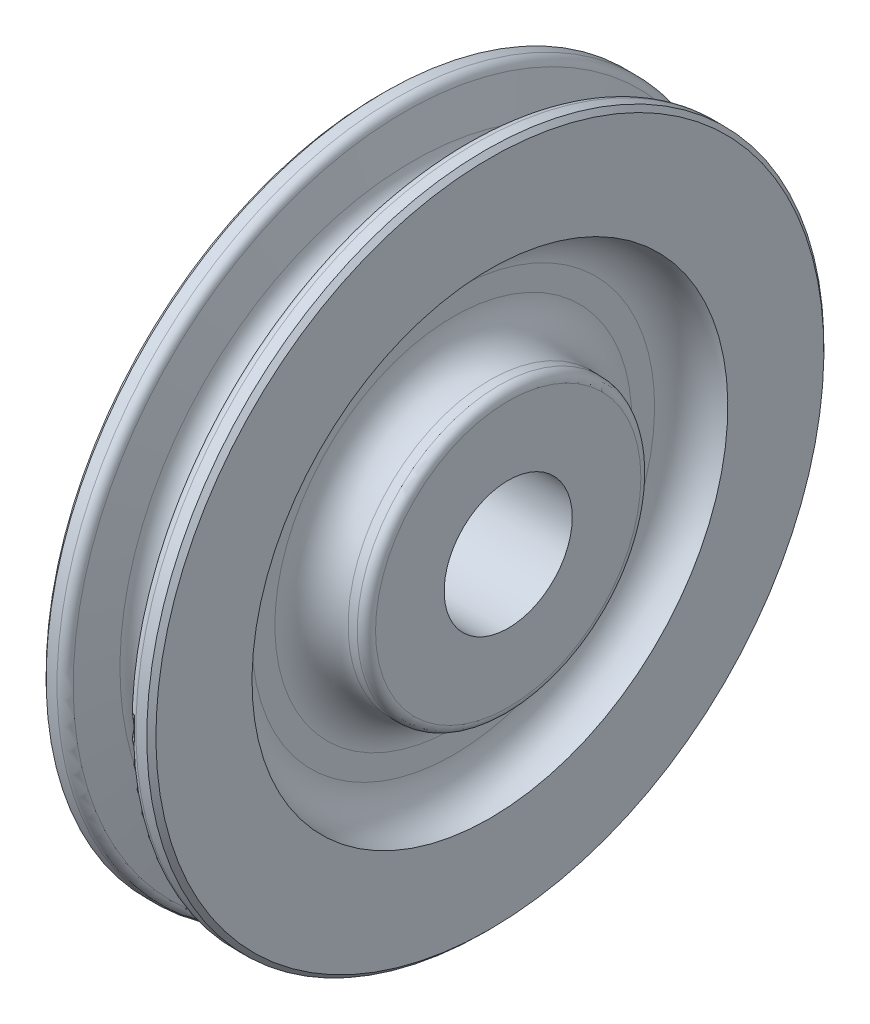
ISO-10303-21;
HEADER;
FILE_DESCRIPTION(('STEP AP214'),'2;1');
FILE_NAME('part.step','',(''),(''),'','','');
FILE_SCHEMA(('AUTOMOTIVE_DESIGN { 1 0 10303 214 1 1 1 1 }'));
ENDSEC;
DATA;
#1=APPLICATION_CONTEXT('core data for automotive mechanical design processes');
#2=APPLICATION_PROTOCOL_DEFINITION('international standard','automotive_design',2000,#1);
#3=PRODUCT_CONTEXT('',#1,'mechanical');
#4=PRODUCT('Part','Part','',(#3));
#5=PRODUCT_RELATED_PRODUCT_CATEGORY('part','',(#4));
#6=PRODUCT_DEFINITION_FORMATION('','',#4);
#7=PRODUCT_DEFINITION_CONTEXT('part definition',#1,'design');
#8=PRODUCT_DEFINITION('design','',#6,#7);
#9=PRODUCT_DEFINITION_SHAPE('','',#8);
#10=(LENGTH_UNIT() NAMED_UNIT(*) SI_UNIT(.MILLI.,.METRE.));
#11=(NAMED_UNIT(*) PLANE_ANGLE_UNIT() SI_UNIT($,.RADIAN.));
#12=(NAMED_UNIT(*) SI_UNIT($,.STERADIAN.) SOLID_ANGLE_UNIT());
#13=UNCERTAINTY_MEASURE_WITH_UNIT(LENGTH_MEASURE(1.E-05),#10,'distance_accuracy_value','');
#14=(GEOMETRIC_REPRESENTATION_CONTEXT(3) GLOBAL_UNCERTAINTY_ASSIGNED_CONTEXT((#13)) GLOBAL_UNIT_ASSIGNED_CONTEXT((#10,
#11,#12)) REPRESENTATION_CONTEXT('',''));
#15=CARTESIAN_POINT('',(0.,0.,0.));
#16=DIRECTION('',(0.,0.,1.));
#17=DIRECTION('',(1.,0.,0.));
#18=AXIS2_PLACEMENT_3D('',#15,#16,#17);
#19=CARTESIAN_POINT('',(0.,0.,0.));
#20=DIRECTION('',(-1.,0.,0.));
#21=DIRECTION('',(0.,-1.,0.));
#22=AXIS2_PLACEMENT_3D('',#19,#20,#21);
#23=TOROIDAL_SURFACE('',#22,51.5937500000002,3.96875);
#24=CARTESIAN_POINT('',(-3.88395786670477,0.,0.));
#25=DIRECTION('',(-1.,0.,0.));
#26=DIRECTION('',(0.,-1.,0.));
#27=AXIS2_PLACEMENT_3D('',#24,#25,#26);
#28=CIRCLE('',#27,50.7777549925632);
#29=CARTESIAN_POINT('',(-3.88395786670477,-50.7777549925632,0.));
#30=VERTEX_POINT('',#29);
#31=EDGE_CURVE('E10',#30,#30,#28,.T.);
#32=ORIENTED_EDGE('',*,*,#31,.F.);
#33=EDGE_LOOP('',(#32));
#34=FACE_BOUND('',#33,.T.);
#35=CARTESIAN_POINT('',(3.88395786670477,0.,0.));
#36=DIRECTION('',(-1.,0.,0.));
#37=DIRECTION('',(0.,-1.,0.));
#38=AXIS2_PLACEMENT_3D('',#35,#36,#37);
#39=CIRCLE('',#38,50.7777549925632);
#40=CARTESIAN_POINT('',(3.88395786670477,-50.7777549925632,0.));
#41=VERTEX_POINT('',#40);
#42=EDGE_CURVE('E422',#41,#41,#39,.T.);
#43=ORIENTED_EDGE('',*,*,#42,.T.);
#44=EDGE_LOOP('',(#43));
#45=FACE_BOUND('',#44,.T.);
#46=ADVANCED_FACE('F352',(#34,#45),#23,.F.);
#47=CARTESIAN_POINT('',(-3.88395786670477,0.,0.));
#48=DIRECTION('',(-1.,0.,0.));
#49=DIRECTION('',(0.,-1.,0.));
#50=AXIS2_PLACEMENT_3D('',#47,#48,#49);
#51=CONICAL_SURFACE('',#50,50.7777549925632,1.36371440951659);
#52=CARTESIAN_POINT('',(-5.29130043855831,0.,0.));
#53=DIRECTION('',(-1.,0.,0.));
#54=DIRECTION('',(0.,-1.,0.));
#55=AXIS2_PLACEMENT_3D('',#52,#53,#54);
#56=CIRCLE('',#55,57.476398002975);
#57=CARTESIAN_POINT('',(-5.29130043855831,-57.476398002975,0.));
#58=VERTEX_POINT('',#57);
#59=EDGE_CURVE('E358',#58,#58,#56,.T.);
#60=ORIENTED_EDGE('',*,*,#59,.F.);
#61=EDGE_LOOP('',(#60));
#62=FACE_BOUND('',#61,.T.);
#63=ORIENTED_EDGE('',*,*,#31,.T.);
#64=EDGE_LOOP('',(#63));
#65=FACE_BOUND('',#64,.T.);
#66=ADVANCED_FACE('F455',(#62,#65),#51,.T.);
#67=CARTESIAN_POINT('',(-6.84488358524021,0.,0.));
#68=DIRECTION('',(-1.,0.,0.));
#69=DIRECTION('',(0.,-1.,0.));
#70=AXIS2_PLACEMENT_3D('',#67,#68,#69);
#71=TOROIDAL_SURFACE('',#70,57.1500000000002,1.5875);
#72=CARTESIAN_POINT('',(-6.84488358524021,0.,0.));
#73=DIRECTION('',(-1.,0.,0.));
#74=DIRECTION('',(0.,-1.,0.));
#75=AXIS2_PLACEMENT_3D('',#72,#73,#74);
#76=CIRCLE('',#75,58.7375000000002);
#77=CARTESIAN_POINT('',(-6.84488358524021,-58.7375000000002,0.));
#78=VERTEX_POINT('',#77);
#79=EDGE_CURVE('E362',#78,#78,#76,.T.);
#80=ORIENTED_EDGE('',*,*,#79,.F.);
#81=EDGE_LOOP('',(#80));
#82=FACE_BOUND('',#81,.T.);
#83=ORIENTED_EDGE('',*,*,#59,.T.);
#84=EDGE_LOOP('',(#83));
#85=FACE_BOUND('',#84,.T.);
#86=ADVANCED_FACE('F460',(#82,#85),#71,.T.);
#87=CARTESIAN_POINT('',(-12.7,0.,0.));
#88=DIRECTION('',(-1.,0.,0.));
#89=DIRECTION('',(0.,-1.,0.));
#90=AXIS2_PLACEMENT_3D('',#87,#88,#89);
#91=CYLINDRICAL_SURFACE('',#90,58.7375000000002);
#92=CARTESIAN_POINT('',(-8.73125,0.,0.));
#93=DIRECTION('',(-1.,0.,0.));
#94=DIRECTION('',(0.,-1.,0.));
#95=AXIS2_PLACEMENT_3D('',#92,#93,#94);
#96=CIRCLE('',#95,58.7375000000002);
#97=CARTESIAN_POINT('',(-8.73125,-58.7375000000002,0.));
#98=VERTEX_POINT('',#97);
#99=EDGE_CURVE('E366',#98,#98,#96,.T.);
#100=ORIENTED_EDGE('',*,*,#99,.F.);
#101=EDGE_LOOP('',(#100));
#102=FACE_BOUND('',#101,.T.);
#103=ORIENTED_EDGE('',*,*,#79,.T.);
#104=EDGE_LOOP('',(#103));
#105=FACE_BOUND('',#104,.T.);
#106=ADVANCED_FACE('F564',(#102,#105),#91,.T.);
#107=CARTESIAN_POINT('',(-8.73125,0.,0.));
#108=DIRECTION('',(1.,0.,0.));
#109=DIRECTION('',(0.,1.,0.));
#110=AXIS2_PLACEMENT_3D('',#107,#108,#109);
#111=CONICAL_SURFACE('',#110,58.7375000000002,0.78539816339744);
#112=CARTESIAN_POINT('',(-9.525,0.,0.));
#113=DIRECTION('',(-1.,0.,0.));
#114=DIRECTION('',(0.,-1.,0.));
#115=AXIS2_PLACEMENT_3D('',#112,#113,#114);
#116=CIRCLE('',#115,57.9437500000002);
#117=CARTESIAN_POINT('',(-9.525,-57.9437500000002,0.));
#118=VERTEX_POINT('',#117);
#119=EDGE_CURVE('E371',#118,#118,#116,.T.);
#120=ORIENTED_EDGE('',*,*,#119,.F.);
#121=EDGE_LOOP('',(#120));
#122=FACE_BOUND('',#121,.T.);
#123=ORIENTED_EDGE('',*,*,#99,.T.);
#124=EDGE_LOOP('',(#123));
#125=FACE_BOUND('',#124,.T.);
#126=ADVANCED_FACE('F558',(#122,#125),#111,.T.);
#127=CARTESIAN_POINT('',(-9.525,57.9437500000002,0.));
#128=DIRECTION('',(1.,0.,0.));
#129=DIRECTION('',(0.,1.,0.));
#130=AXIS2_PLACEMENT_3D('',#127,#128,#129);
#131=PLANE('',#130);
#132=CARTESIAN_POINT('',(-9.525,0.,0.));
#133=DIRECTION('',(-1.,0.,0.));
#134=DIRECTION('',(0.,-1.,0.));
#135=AXIS2_PLACEMENT_3D('',#132,#133,#134);
#136=CIRCLE('',#135,41.2750000000002);
#137=CARTESIAN_POINT('',(-9.525,-41.2750000000002,0.));
#138=VERTEX_POINT('',#137);
#139=EDGE_CURVE('E374',#138,#138,#136,.T.);
#140=ORIENTED_EDGE('',*,*,#139,.F.);
#141=EDGE_LOOP('',(#140));
#142=FACE_BOUND('',#141,.T.);
#143=ORIENTED_EDGE('',*,*,#119,.T.);
#144=EDGE_LOOP('',(#143));
#145=FACE_BOUND('',#144,.T.);
#146=ADVANCED_FACE('F552',(#142,#145),#131,.F.);
#147=CARTESIAN_POINT('',(-9.525,0.,0.));
#148=DIRECTION('',(-1.,0.,0.));
#149=DIRECTION('',(0.,-1.,0.));
#150=AXIS2_PLACEMENT_3D('',#147,#148,#149);
#151=TOROIDAL_SURFACE('',#150,34.9250000000002,6.35);
#152=CARTESIAN_POINT('',(-3.175,0.,0.));
#153=DIRECTION('',(-1.,0.,0.));
#154=DIRECTION('',(0.,-1.,0.));
#155=AXIS2_PLACEMENT_3D('',#152,#153,#154);
#156=CIRCLE('',#155,34.9250000000002);
#157=CARTESIAN_POINT('',(-3.175,-34.9250000000002,0.));
#158=VERTEX_POINT('',#157);
#159=EDGE_CURVE('E377',#158,#158,#156,.T.);
#160=ORIENTED_EDGE('',*,*,#159,.F.);
#161=EDGE_LOOP('',(#160));
#162=FACE_BOUND('',#161,.T.);
#163=ORIENTED_EDGE('',*,*,#139,.T.);
#164=EDGE_LOOP('',(#163));
#165=FACE_BOUND('',#164,.T.);
#166=ADVANCED_FACE('F546',(#162,#165),#151,.F.);
#167=CARTESIAN_POINT('',(-3.175,34.9250000000002,0.));
#168=DIRECTION('',(1.,0.,0.));
#169=DIRECTION('',(0.,1.,0.));
#170=AXIS2_PLACEMENT_3D('',#167,#168,#169);
#171=PLANE('',#170);
#172=CARTESIAN_POINT('',(-3.175,0.,0.));
#173=DIRECTION('',(-1.,0.,0.));
#174=DIRECTION('',(0.,-1.,0.));
#175=AXIS2_PLACEMENT_3D('',#172,#173,#174);
#176=CIRCLE('',#175,30.9562500000002);
#177=CARTESIAN_POINT('',(-3.175,-30.9562500000002,0.));
#178=VERTEX_POINT('',#177);
#179=EDGE_CURVE('E380',#178,#178,#176,.T.);
#180=ORIENTED_EDGE('',*,*,#179,.F.);
#181=EDGE_LOOP('',(#180));
#182=FACE_BOUND('',#181,.T.);
#183=ORIENTED_EDGE('',*,*,#159,.T.);
#184=EDGE_LOOP('',(#183));
#185=FACE_BOUND('',#184,.T.);
#186=ADVANCED_FACE('F540',(#182,#185),#171,.F.);
#187=CARTESIAN_POINT('',(-9.525,0.,0.));
#188=DIRECTION('',(-1.,0.,0.));
#189=DIRECTION('',(0.,-1.,0.));
#190=AXIS2_PLACEMENT_3D('',#187,#188,#189);
#191=TOROIDAL_SURFACE('',#190,30.9562500000002,6.35);
#192=CARTESIAN_POINT('',(-9.525,0.,0.));
#193=DIRECTION('',(-1.,0.,0.));
#194=DIRECTION('',(0.,-1.,0.));
#195=AXIS2_PLACEMENT_3D('',#192,#193,#194);
#196=CIRCLE('',#195,24.6062500000002);
#197=CARTESIAN_POINT('',(-9.525,-24.6062500000002,0.));
#198=VERTEX_POINT('',#197);
#199=EDGE_CURVE('E383',#198,#198,#196,.T.);
#200=ORIENTED_EDGE('',*,*,#199,.F.);
#201=EDGE_LOOP('',(#200));
#202=FACE_BOUND('',#201,.T.);
#203=ORIENTED_EDGE('',*,*,#179,.T.);
#204=EDGE_LOOP('',(#203));
#205=FACE_BOUND('',#204,.T.);
#206=ADVANCED_FACE('F534',(#202,#205),#191,.F.);
#207=CARTESIAN_POINT('',(-12.7,0.,0.));
#208=DIRECTION('',(-1.,0.,0.));
#209=DIRECTION('',(0.,-1.,0.));
#210=AXIS2_PLACEMENT_3D('',#207,#208,#209);
#211=CYLINDRICAL_SURFACE('',#210,24.6062500000001);
#212=CARTESIAN_POINT('',(-11.1125000000001,0.,0.));
#213=DIRECTION('',(-1.,0.,0.));
#214=DIRECTION('',(0.,-1.,0.));
#215=AXIS2_PLACEMENT_3D('',#212,#213,#214);
#216=CIRCLE('',#215,24.6062499999999);
#217=CARTESIAN_POINT('',(-11.1125000000001,-24.6062499999999,0.));
#218=VERTEX_POINT('',#217);
#219=EDGE_CURVE('E386',#218,#218,#216,.T.);
#220=ORIENTED_EDGE('',*,*,#219,.F.);
#221=EDGE_LOOP('',(#220));
#222=FACE_BOUND('',#221,.T.);
#223=ORIENTED_EDGE('',*,*,#199,.T.);
#224=EDGE_LOOP('',(#223));
#225=FACE_BOUND('',#224,.T.);
#226=ADVANCED_FACE('F528',(#222,#225),#211,.T.);
#227=CARTESIAN_POINT('',(-11.1125,0.,0.));
#228=DIRECTION('',(-1.,0.,0.));
#229=DIRECTION('',(0.,-1.,0.));
#230=AXIS2_PLACEMENT_3D('',#227,#228,#229);
#231=TOROIDAL_SURFACE('',#230,23.0187499999999,1.5875);
#232=CARTESIAN_POINT('',(-12.7,0.,0.));
#233=DIRECTION('',(-1.,0.,0.));
#234=DIRECTION('',(0.,-1.,0.));
#235=AXIS2_PLACEMENT_3D('',#232,#233,#234);
#236=CIRCLE('',#235,23.0187499999999);
#237=CARTESIAN_POINT('',(-12.7,-23.0187499999999,0.));
#238=VERTEX_POINT('',#237);
#239=EDGE_CURVE('E389',#238,#238,#236,.T.);
#240=ORIENTED_EDGE('',*,*,#239,.F.);
#241=EDGE_LOOP('',(#240));
#242=FACE_BOUND('',#241,.T.);
#243=ORIENTED_EDGE('',*,*,#219,.T.);
#244=EDGE_LOOP('',(#243));
#245=FACE_BOUND('',#244,.T.);
#246=ADVANCED_FACE('F523',(#242,#245),#231,.T.);
#247=CARTESIAN_POINT('',(-12.7,23.0187499999999,0.));
#248=DIRECTION('',(1.,0.,0.));
#249=DIRECTION('',(0.,1.,0.));
#250=AXIS2_PLACEMENT_3D('',#247,#248,#249);
#251=PLANE('',#250);
#252=CARTESIAN_POINT('',(-12.7,0.,0.));
#253=DIRECTION('',(1.,0.,0.));
#254=DIRECTION('',(0.,0.,-1.));
#255=AXIS2_PLACEMENT_3D('',#252,#253,#254);
#256=CIRCLE('',#255,11.1125);
#257=CARTESIAN_POINT('',(-12.7,0.,-11.1125));
#258=VERTEX_POINT('',#257);
#259=EDGE_CURVE('E425',#258,#258,#256,.T.);
#260=ORIENTED_EDGE('',*,*,#259,.T.);
#261=EDGE_LOOP('',(#260));
#262=FACE_BOUND('',#261,.T.);
#263=ORIENTED_EDGE('',*,*,#239,.T.);
#264=EDGE_LOOP('',(#263));
#265=FACE_BOUND('',#264,.T.);
#266=ADVANCED_FACE('F438',(#262,#265),#251,.F.);
#267=CARTESIAN_POINT('',(12.7,23.0187499999999,0.));
#268=DIRECTION('',(-1.,0.,0.));
#269=DIRECTION('',(0.,-1.,0.));
#270=AXIS2_PLACEMENT_3D('',#267,#268,#269);
#271=PLANE('',#270);
#272=CARTESIAN_POINT('',(12.7,0.,0.));
#273=DIRECTION('',(1.,0.,0.));
#274=DIRECTION('',(0.,0.,-1.));
#275=AXIS2_PLACEMENT_3D('',#272,#273,#274);
#276=CIRCLE('',#275,11.1125);
#277=CARTESIAN_POINT('',(12.7,0.,-11.1125));
#278=VERTEX_POINT('',#277);
#279=EDGE_CURVE('E428',#278,#278,#276,.T.);
#280=ORIENTED_EDGE('',*,*,#279,.F.);
#281=EDGE_LOOP('',(#280));
#282=FACE_BOUND('',#281,.T.);
#283=CARTESIAN_POINT('',(12.7,0.,0.));
#284=DIRECTION('',(-1.,0.,0.));
#285=DIRECTION('',(0.,-1.,0.));
#286=AXIS2_PLACEMENT_3D('',#283,#284,#285);
#287=CIRCLE('',#286,23.0187499999999);
#288=CARTESIAN_POINT('',(12.7,-23.0187499999999,0.));
#289=VERTEX_POINT('',#288);
#290=EDGE_CURVE('E392',#289,#289,#287,.T.);
#291=ORIENTED_EDGE('',*,*,#290,.F.);
#292=EDGE_LOOP('',(#291));
#293=FACE_BOUND('',#292,.T.);
#294=ADVANCED_FACE('F434',(#282,#293),#271,.F.);
#295=CARTESIAN_POINT('',(11.1125,0.,0.));
#296=DIRECTION('',(-1.,0.,0.));
#297=DIRECTION('',(0.,-1.,0.));
#298=AXIS2_PLACEMENT_3D('',#295,#296,#297);
#299=TOROIDAL_SURFACE('',#298,23.0187499999999,1.5875);
#300=CARTESIAN_POINT('',(11.1125000000001,0.,0.));
#301=DIRECTION('',(-1.,0.,0.));
#302=DIRECTION('',(0.,-1.,0.));
#303=AXIS2_PLACEMENT_3D('',#300,#301,#302);
#304=CIRCLE('',#303,24.6062499999999);
#305=CARTESIAN_POINT('',(11.1125000000001,-24.6062499999999,0.));
#306=VERTEX_POINT('',#305);
#307=EDGE_CURVE('E395',#306,#306,#304,.T.);
#308=ORIENTED_EDGE('',*,*,#307,.F.);
#309=EDGE_LOOP('',(#308));
#310=FACE_BOUND('',#309,.T.);
#311=ORIENTED_EDGE('',*,*,#290,.T.);
#312=EDGE_LOOP('',(#311));
#313=FACE_BOUND('',#312,.T.);
#314=ADVANCED_FACE('F437',(#310,#313),#299,.T.);
#315=CARTESIAN_POINT('',(-12.7,0.,0.));
#316=DIRECTION('',(-1.,0.,0.));
#317=DIRECTION('',(0.,-1.,0.));
#318=AXIS2_PLACEMENT_3D('',#315,#316,#317);
#319=CYLINDRICAL_SURFACE('',#318,24.6062500000001);
#320=CARTESIAN_POINT('',(9.525,0.,0.));
#321=DIRECTION('',(-1.,0.,0.));
#322=DIRECTION('',(0.,-1.,0.));
#323=AXIS2_PLACEMENT_3D('',#320,#321,#322);
#324=CIRCLE('',#323,24.6062500000002);
#325=CARTESIAN_POINT('',(9.525,-24.6062500000002,0.));
#326=VERTEX_POINT('',#325);
#327=EDGE_CURVE('E398',#326,#326,#324,.T.);
#328=ORIENTED_EDGE('',*,*,#327,.F.);
#329=EDGE_LOOP('',(#328));
#330=FACE_BOUND('',#329,.T.);
#331=ORIENTED_EDGE('',*,*,#307,.T.);
#332=EDGE_LOOP('',(#331));
#333=FACE_BOUND('',#332,.T.);
#334=ADVANCED_FACE('F443',(#330,#333),#319,.T.);
#335=CARTESIAN_POINT('',(9.525,0.,0.));
#336=DIRECTION('',(-1.,0.,0.));
#337=DIRECTION('',(0.,-1.,0.));
#338=AXIS2_PLACEMENT_3D('',#335,#336,#337);
#339=TOROIDAL_SURFACE('',#338,30.9562500000002,6.35);
#340=CARTESIAN_POINT('',(3.175,0.,0.));
#341=DIRECTION('',(-1.,0.,0.));
#342=DIRECTION('',(0.,-1.,0.));
#343=AXIS2_PLACEMENT_3D('',#340,#341,#342);
#344=CIRCLE('',#343,30.9562500000002);
#345=CARTESIAN_POINT('',(3.175,-30.9562500000002,0.));
#346=VERTEX_POINT('',#345);
#347=EDGE_CURVE('E401',#346,#346,#344,.T.);
#348=ORIENTED_EDGE('',*,*,#347,.F.);
#349=EDGE_LOOP('',(#348));
#350=FACE_BOUND('',#349,.T.);
#351=ORIENTED_EDGE('',*,*,#327,.T.);
#352=EDGE_LOOP('',(#351));
#353=FACE_BOUND('',#352,.T.);
#354=ADVANCED_FACE('F450',(#350,#353),#339,.F.);
#355=CARTESIAN_POINT('',(3.17500000000001,34.9249999999998,0.));
#356=DIRECTION('',(-1.,0.,0.));
#357=DIRECTION('',(0.,-1.,0.));
#358=AXIS2_PLACEMENT_3D('',#355,#356,#357);
#359=PLANE('',#358);
#360=CARTESIAN_POINT('',(3.17500000000001,0.,0.));
#361=DIRECTION('',(-1.,0.,0.));
#362=DIRECTION('',(0.,-1.,0.));
#363=AXIS2_PLACEMENT_3D('',#360,#361,#362);
#364=CIRCLE('',#363,34.9249999999998);
#365=CARTESIAN_POINT('',(3.17500000000001,-34.9249999999998,0.));
#366=VERTEX_POINT('',#365);
#367=EDGE_CURVE('E404',#366,#366,#364,.T.);
#368=ORIENTED_EDGE('',*,*,#367,.F.);
#369=EDGE_LOOP('',(#368));
#370=FACE_BOUND('',#369,.T.);
#371=ORIENTED_EDGE('',*,*,#347,.T.);
#372=EDGE_LOOP('',(#371));
#373=FACE_BOUND('',#372,.T.);
#374=ADVANCED_FACE('F498',(#370,#373),#359,.F.);
#375=CARTESIAN_POINT('',(9.525,0.,0.));
#376=DIRECTION('',(-1.,0.,0.));
#377=DIRECTION('',(0.,-1.,0.));
#378=AXIS2_PLACEMENT_3D('',#375,#376,#377);
#379=TOROIDAL_SURFACE('',#378,34.9249999999998,6.34999999999999);
#380=CARTESIAN_POINT('',(9.525,0.,0.));
#381=DIRECTION('',(-1.,0.,0.));
#382=DIRECTION('',(0.,-1.,0.));
#383=AXIS2_PLACEMENT_3D('',#380,#381,#382);
#384=CIRCLE('',#383,41.2749999999998);
#385=CARTESIAN_POINT('',(9.525,-41.2749999999998,0.));
#386=VERTEX_POINT('',#385);
#387=EDGE_CURVE('E407',#386,#386,#384,.T.);
#388=ORIENTED_EDGE('',*,*,#387,.F.);
#389=EDGE_LOOP('',(#388));
#390=FACE_BOUND('',#389,.T.);
#391=ORIENTED_EDGE('',*,*,#367,.T.);
#392=EDGE_LOOP('',(#391));
#393=FACE_BOUND('',#392,.T.);
#394=ADVANCED_FACE('F492',(#390,#393),#379,.F.);
#395=CARTESIAN_POINT('',(9.525,57.9437500000002,0.));
#396=DIRECTION('',(-1.,0.,0.));
#397=DIRECTION('',(0.,-1.,0.));
#398=AXIS2_PLACEMENT_3D('',#395,#396,#397);
#399=PLANE('',#398);
#400=CARTESIAN_POINT('',(9.525,0.,0.));
#401=DIRECTION('',(-1.,0.,0.));
#402=DIRECTION('',(0.,-1.,0.));
#403=AXIS2_PLACEMENT_3D('',#400,#401,#402);
#404=CIRCLE('',#403,57.9437500000002);
#405=CARTESIAN_POINT('',(9.525,-57.9437500000002,0.));
#406=VERTEX_POINT('',#405);
#407=EDGE_CURVE('E410',#406,#406,#404,.T.);
#408=ORIENTED_EDGE('',*,*,#407,.F.);
#409=EDGE_LOOP('',(#408));
#410=FACE_BOUND('',#409,.T.);
#411=ORIENTED_EDGE('',*,*,#387,.T.);
#412=EDGE_LOOP('',(#411));
#413=FACE_BOUND('',#412,.T.);
#414=ADVANCED_FACE('F486',(#410,#413),#399,.F.);
#415=CARTESIAN_POINT('',(9.525,0.,0.));
#416=DIRECTION('',(-1.,0.,0.));
#417=DIRECTION('',(0.,-1.,0.));
#418=AXIS2_PLACEMENT_3D('',#415,#416,#417);
#419=CONICAL_SURFACE('',#418,57.9437500000002,0.78539816339744);
#420=CARTESIAN_POINT('',(8.73125,0.,0.));
#421=DIRECTION('',(-1.,0.,0.));
#422=DIRECTION('',(0.,-1.,0.));
#423=AXIS2_PLACEMENT_3D('',#420,#421,#422);
#424=CIRCLE('',#423,58.7375000000002);
#425=CARTESIAN_POINT('',(8.73125,-58.7375000000002,0.));
#426=VERTEX_POINT('',#425);
#427=EDGE_CURVE('E413',#426,#426,#424,.T.);
#428=ORIENTED_EDGE('',*,*,#427,.F.);
#429=EDGE_LOOP('',(#428));
#430=FACE_BOUND('',#429,.T.);
#431=ORIENTED_EDGE('',*,*,#407,.T.);
#432=EDGE_LOOP('',(#431));
#433=FACE_BOUND('',#432,.T.);
#434=ADVANCED_FACE('F480',(#430,#433),#419,.T.);
#435=CARTESIAN_POINT('',(-12.7,0.,0.));
#436=DIRECTION('',(-1.,0.,0.));
#437=DIRECTION('',(0.,-1.,0.));
#438=AXIS2_PLACEMENT_3D('',#435,#436,#437);
#439=CYLINDRICAL_SURFACE('',#438,58.7375000000002);
#440=CARTESIAN_POINT('',(6.84488358524021,0.,0.));
#441=DIRECTION('',(-1.,0.,0.));
#442=DIRECTION('',(0.,-1.,0.));
#443=AXIS2_PLACEMENT_3D('',#440,#441,#442);
#444=CIRCLE('',#443,58.7375000000002);
#445=CARTESIAN_POINT('',(6.84488358524021,-58.7375000000002,0.));
#446=VERTEX_POINT('',#445);
#447=EDGE_CURVE('E416',#446,#446,#444,.T.);
#448=ORIENTED_EDGE('',*,*,#447,.F.);
#449=EDGE_LOOP('',(#448));
#450=FACE_BOUND('',#449,.T.);
#451=ORIENTED_EDGE('',*,*,#427,.T.);
#452=EDGE_LOOP('',(#451));
#453=FACE_BOUND('',#452,.T.);
#454=ADVANCED_FACE('F474',(#450,#453),#439,.T.);
#455=CARTESIAN_POINT('',(6.84488358524021,0.,0.));
#456=DIRECTION('',(-1.,0.,0.));
#457=DIRECTION('',(0.,-1.,0.));
#458=AXIS2_PLACEMENT_3D('',#455,#456,#457);
#459=TOROIDAL_SURFACE('',#458,57.1500000000002,1.5875);
#460=CARTESIAN_POINT('',(5.2913004385583,0.,0.));
#461=DIRECTION('',(-1.,0.,0.));
#462=DIRECTION('',(0.,-1.,0.));
#463=AXIS2_PLACEMENT_3D('',#460,#461,#462);
#464=CIRCLE('',#463,57.476398002975);
#465=CARTESIAN_POINT('',(5.2913004385583,-57.476398002975,0.));
#466=VERTEX_POINT('',#465);
#467=EDGE_CURVE('E419',#466,#466,#464,.T.);
#468=ORIENTED_EDGE('',*,*,#467,.F.);
#469=EDGE_LOOP('',(#468));
#470=FACE_BOUND('',#469,.T.);
#471=ORIENTED_EDGE('',*,*,#447,.T.);
#472=EDGE_LOOP('',(#471));
#473=FACE_BOUND('',#472,.T.);
#474=ADVANCED_FACE('F468',(#470,#473),#459,.T.);
#475=CARTESIAN_POINT('',(5.2913004385583,0.,0.));
#476=DIRECTION('',(1.,0.,0.));
#477=DIRECTION('',(0.,1.,0.));
#478=AXIS2_PLACEMENT_3D('',#475,#476,#477);
#479=CONICAL_SURFACE('',#478,57.476398002975,1.36371440951659);
#480=ORIENTED_EDGE('',*,*,#42,.F.);
#481=EDGE_LOOP('',(#480));
#482=FACE_BOUND('',#481,.T.);
#483=ORIENTED_EDGE('',*,*,#467,.T.);
#484=EDGE_LOOP('',(#483));
#485=FACE_BOUND('',#484,.T.);
#486=ADVANCED_FACE('F465',(#482,#485),#479,.T.);
#487=CARTESIAN_POINT('',(-12.7,0.,0.));
#488=DIRECTION('',(1.,0.,0.));
#489=DIRECTION('',(0.,0.,-1.));
#490=AXIS2_PLACEMENT_3D('',#487,#488,#489);
#491=CYLINDRICAL_SURFACE('',#490,11.1125);
#492=ORIENTED_EDGE('',*,*,#259,.F.);
#493=EDGE_LOOP('',(#492));
#494=FACE_BOUND('',#493,.T.);
#495=ORIENTED_EDGE('',*,*,#279,.T.);
#496=EDGE_LOOP('',(#495));
#497=FACE_BOUND('',#496,.T.);
#498=ADVANCED_FACE('F432',(#494,#497),#491,.F.);
#499=CLOSED_SHELL('',(#46,#66,#86,#106,#126,#146,#166,#186,#206,#226,#246,#266,#294,#314,#334,
#354,#374,#394,#414,#434,#454,#474,#486,#498));
#500=MANIFOLD_SOLID_BREP('B2',#499);
#501=ADVANCED_BREP_SHAPE_REPRESENTATION('',(#18,#500),#14);
#502=SHAPE_DEFINITION_REPRESENTATION(#9,#501);
ENDSEC;
END-ISO-10303-21;
